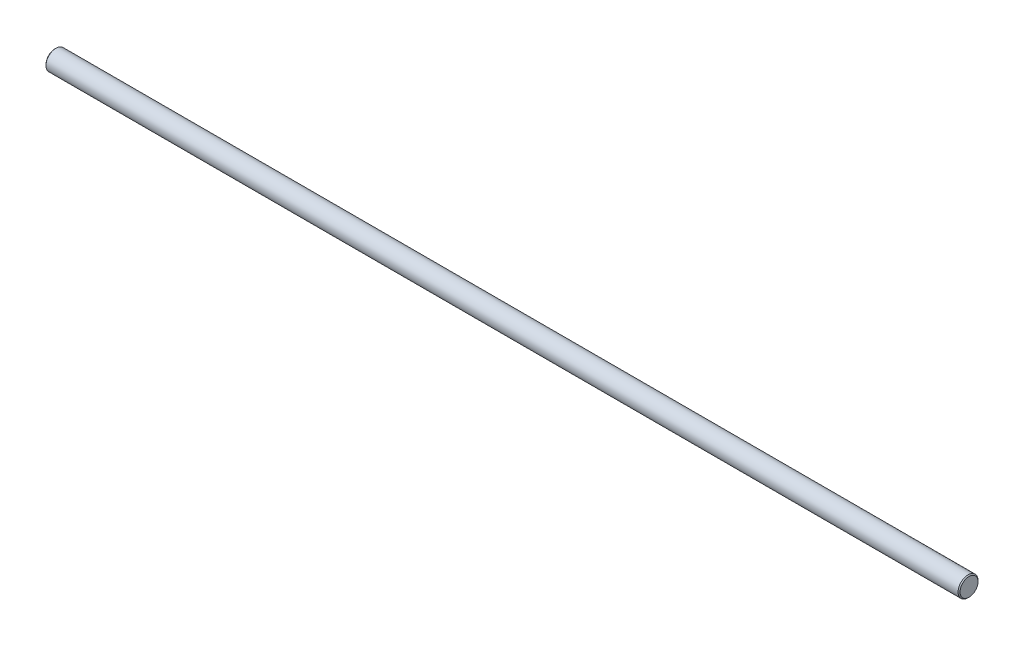
ISO-10303-21;
HEADER;
FILE_DESCRIPTION(('STEP AP214'),'2;1');
FILE_NAME('part.step','',(''),(''),'','','');
FILE_SCHEMA(('AUTOMOTIVE_DESIGN { 1 0 10303 214 1 1 1 1 }'));
ENDSEC;
DATA;
#1=APPLICATION_CONTEXT('core data for automotive mechanical design processes');
#2=APPLICATION_PROTOCOL_DEFINITION('international standard','automotive_design',2000,#1);
#3=PRODUCT_CONTEXT('',#1,'mechanical');
#4=PRODUCT('Part','Part','',(#3));
#5=PRODUCT_RELATED_PRODUCT_CATEGORY('part','',(#4));
#6=PRODUCT_DEFINITION_FORMATION('','',#4);
#7=PRODUCT_DEFINITION_CONTEXT('part definition',#1,'design');
#8=PRODUCT_DEFINITION('design','',#6,#7);
#9=PRODUCT_DEFINITION_SHAPE('','',#8);
#10=(LENGTH_UNIT() NAMED_UNIT(*) SI_UNIT(.MILLI.,.METRE.));
#11=(NAMED_UNIT(*) PLANE_ANGLE_UNIT() SI_UNIT($,.RADIAN.));
#12=(NAMED_UNIT(*) SI_UNIT($,.STERADIAN.) SOLID_ANGLE_UNIT());
#13=UNCERTAINTY_MEASURE_WITH_UNIT(LENGTH_MEASURE(1.E-05),#10,'distance_accuracy_value','');
#14=(GEOMETRIC_REPRESENTATION_CONTEXT(3) GLOBAL_UNCERTAINTY_ASSIGNED_CONTEXT((#13)) GLOBAL_UNIT_ASSIGNED_CONTEXT((#10,
#11,#12)) REPRESENTATION_CONTEXT('',''));
#15=CARTESIAN_POINT('',(0.,0.,0.));
#16=DIRECTION('',(0.,0.,1.));
#17=DIRECTION('',(1.,0.,0.));
#18=AXIS2_PLACEMENT_3D('',#15,#16,#17);
#19=CARTESIAN_POINT('',(0.,0.,0.));
#20=DIRECTION('',(1.,0.,0.));
#21=DIRECTION('',(0.,0.,-1.));
#22=AXIS2_PLACEMENT_3D('',#19,#20,#21);
#23=PLANE('',#22);
#24=CARTESIAN_POINT('',(0.,0.,0.));
#25=DIRECTION('',(-1.,0.,0.));
#26=DIRECTION('',(0.,0.,1.));
#27=AXIS2_PLACEMENT_3D('',#24,#25,#26);
#28=CIRCLE('',#27,4.5);
#29=CARTESIAN_POINT('',(0.,0.,4.5));
#30=VERTEX_POINT('',#29);
#31=EDGE_CURVE('E10',#30,#30,#28,.T.);
#32=ORIENTED_EDGE('',*,*,#31,.T.);
#33=EDGE_LOOP('',(#32));
#34=FACE_BOUND('',#33,.T.);
#35=ADVANCED_FACE('F30',(#34),#23,.F.);
#36=CARTESIAN_POINT('',(0.5,0.,0.));
#37=DIRECTION('',(1.,0.,0.));
#38=DIRECTION('',(0.,0.,-1.));
#39=AXIS2_PLACEMENT_3D('',#36,#37,#38);
#40=CONICAL_SURFACE('',#39,5.,0.785398163397448);
#41=ORIENTED_EDGE('',*,*,#31,.F.);
#42=EDGE_LOOP('',(#41));
#43=FACE_BOUND('',#42,.T.);
#44=CARTESIAN_POINT('',(0.5,0.,0.));
#45=DIRECTION('',(-1.,0.,0.));
#46=DIRECTION('',(0.,0.,1.));
#47=AXIS2_PLACEMENT_3D('',#44,#45,#46);
#48=CIRCLE('',#47,5.);
#49=CARTESIAN_POINT('',(0.5,0.,5.));
#50=VERTEX_POINT('',#49);
#51=EDGE_CURVE('E36',#50,#50,#48,.T.);
#52=ORIENTED_EDGE('',*,*,#51,.T.);
#53=EDGE_LOOP('',(#52));
#54=FACE_BOUND('',#53,.T.);
#55=ADVANCED_FACE('F62',(#43,#54),#40,.T.);
#56=CARTESIAN_POINT('',(458.,0.,0.));
#57=DIRECTION('',(-1.,0.,0.));
#58=DIRECTION('',(0.,0.,1.));
#59=AXIS2_PLACEMENT_3D('',#56,#57,#58);
#60=CYLINDRICAL_SURFACE('',#59,5.);
#61=ORIENTED_EDGE('',*,*,#51,.F.);
#62=EDGE_LOOP('',(#61));
#63=FACE_BOUND('',#62,.T.);
#64=CARTESIAN_POINT('',(457.5,0.,0.));
#65=DIRECTION('',(-1.,0.,0.));
#66=DIRECTION('',(0.,0.,1.));
#67=AXIS2_PLACEMENT_3D('',#64,#65,#66);
#68=CIRCLE('',#67,5.);
#69=CARTESIAN_POINT('',(457.5,0.,5.));
#70=VERTEX_POINT('',#69);
#71=EDGE_CURVE('E40',#70,#70,#68,.T.);
#72=ORIENTED_EDGE('',*,*,#71,.T.);
#73=EDGE_LOOP('',(#72));
#74=FACE_BOUND('',#73,.T.);
#75=ADVANCED_FACE('F58',(#63,#74),#60,.T.);
#76=CARTESIAN_POINT('',(458.,0.,0.));
#77=DIRECTION('',(-1.,0.,0.));
#78=DIRECTION('',(0.,0.,1.));
#79=AXIS2_PLACEMENT_3D('',#76,#77,#78);
#80=CONICAL_SURFACE('',#79,4.5,0.785398163397448);
#81=ORIENTED_EDGE('',*,*,#71,.F.);
#82=EDGE_LOOP('',(#81));
#83=FACE_BOUND('',#82,.T.);
#84=CARTESIAN_POINT('',(458.,0.,0.));
#85=DIRECTION('',(-1.,0.,0.));
#86=DIRECTION('',(0.,0.,1.));
#87=AXIS2_PLACEMENT_3D('',#84,#85,#86);
#88=CIRCLE('',#87,4.5);
#89=CARTESIAN_POINT('',(458.,0.,4.5));
#90=VERTEX_POINT('',#89);
#91=EDGE_CURVE('E44',#90,#90,#88,.T.);
#92=ORIENTED_EDGE('',*,*,#91,.T.);
#93=EDGE_LOOP('',(#92));
#94=FACE_BOUND('',#93,.T.);
#95=ADVANCED_FACE('F50',(#83,#94),#80,.T.);
#96=CARTESIAN_POINT('',(458.,4.5,0.));
#97=DIRECTION('',(-1.,0.,0.));
#98=DIRECTION('',(0.,0.,1.));
#99=AXIS2_PLACEMENT_3D('',#96,#97,#98);
#100=PLANE('',#99);
#101=ORIENTED_EDGE('',*,*,#91,.F.);
#102=EDGE_LOOP('',(#101));
#103=FACE_BOUND('',#102,.T.);
#104=ADVANCED_FACE('F52',(#103),#100,.F.);
#105=CLOSED_SHELL('',(#35,#55,#75,#95,#104));
#106=MANIFOLD_SOLID_BREP('B2',#105);
#107=ADVANCED_BREP_SHAPE_REPRESENTATION('',(#18,#106),#14);
#108=SHAPE_DEFINITION_REPRESENTATION(#9,#107);
ENDSEC;
END-ISO-10303-21;
